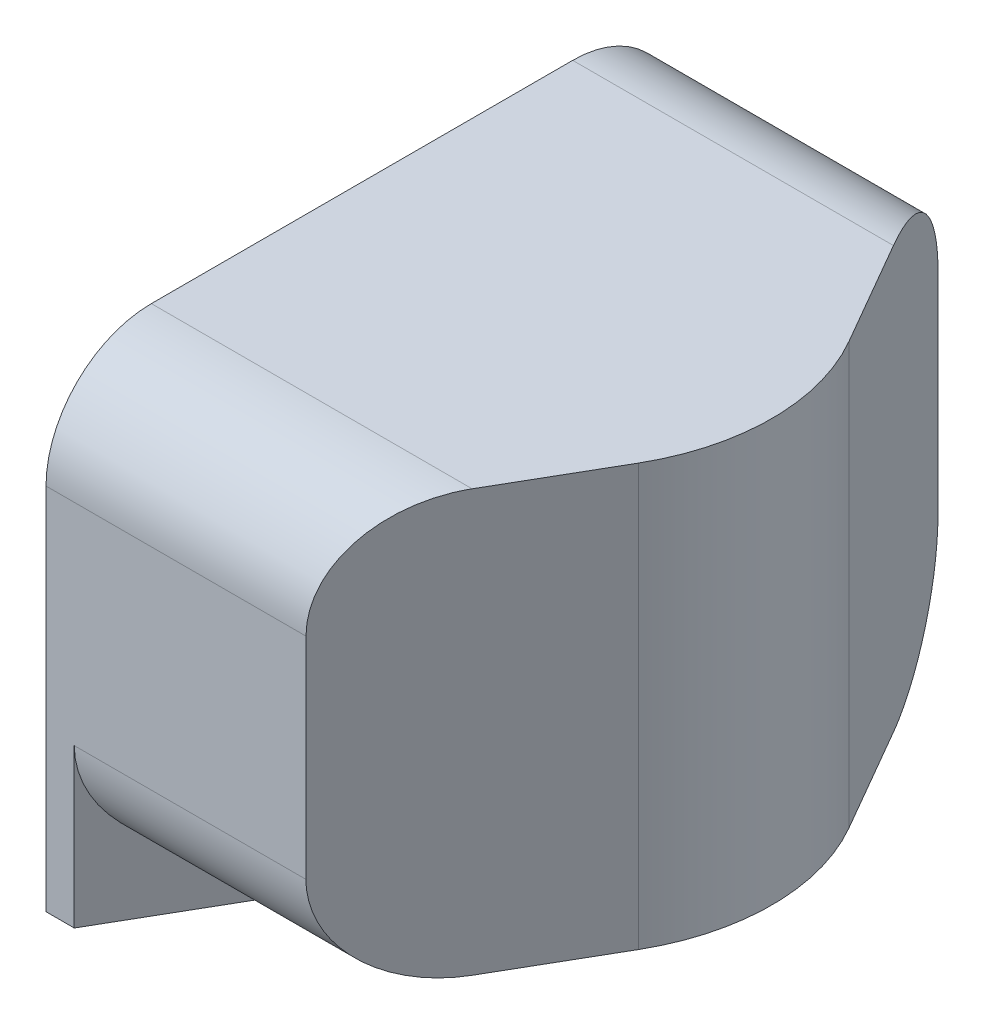
ISO-10303-21;
HEADER;
FILE_DESCRIPTION(('STEP AP214'),'2;1');
FILE_NAME('part.step','',(''),(''),'','','');
FILE_SCHEMA(('AUTOMOTIVE_DESIGN { 1 0 10303 214 1 1 1 1 }'));
ENDSEC;
DATA;
#1=APPLICATION_CONTEXT('core data for automotive mechanical design processes');
#2=APPLICATION_PROTOCOL_DEFINITION('international standard','automotive_design',2000,#1);
#3=PRODUCT_CONTEXT('',#1,'mechanical');
#4=PRODUCT('Part','Part','',(#3));
#5=PRODUCT_RELATED_PRODUCT_CATEGORY('part','',(#4));
#6=PRODUCT_DEFINITION_FORMATION('','',#4);
#7=PRODUCT_DEFINITION_CONTEXT('part definition',#1,'design');
#8=PRODUCT_DEFINITION('design','',#6,#7);
#9=PRODUCT_DEFINITION_SHAPE('','',#8);
#10=(LENGTH_UNIT() NAMED_UNIT(*) SI_UNIT(.MILLI.,.METRE.));
#11=(NAMED_UNIT(*) PLANE_ANGLE_UNIT() SI_UNIT($,.RADIAN.));
#12=(NAMED_UNIT(*) SI_UNIT($,.STERADIAN.) SOLID_ANGLE_UNIT());
#13=UNCERTAINTY_MEASURE_WITH_UNIT(LENGTH_MEASURE(1.E-05),#10,'distance_accuracy_value','');
#14=(GEOMETRIC_REPRESENTATION_CONTEXT(3) GLOBAL_UNCERTAINTY_ASSIGNED_CONTEXT((#13)) GLOBAL_UNIT_ASSIGNED_CONTEXT((#10,
#11,#12)) REPRESENTATION_CONTEXT('',''));
#15=CARTESIAN_POINT('',(0.,0.,0.));
#16=DIRECTION('',(0.,0.,1.));
#17=DIRECTION('',(1.,0.,0.));
#18=AXIS2_PLACEMENT_3D('',#15,#16,#17);
#19=CARTESIAN_POINT('',(18.8,-2.,-3.));
#20=DIRECTION('',(0.,0.,-1.));
#21=DIRECTION('',(-1.,0.,0.));
#22=AXIS2_PLACEMENT_3D('',#19,#20,#21);
#23=PLANE('',#22);
#24=DIRECTION('',(0.,1.,0.));
#25=VECTOR('',#24,1.);
#26=CARTESIAN_POINT('',(18.8,-2.,-3.));
#27=LINE('',#26,#25);
#28=CARTESIAN_POINT('',(18.8,-2.5,-3.));
#29=VERTEX_POINT('',#28);
#30=CARTESIAN_POINT('',(18.8,1.,-3.));
#31=VERTEX_POINT('',#30);
#32=EDGE_CURVE('E155',#29,#31,#27,.T.);
#33=ORIENTED_EDGE('',*,*,#32,.T.);
#34=DIRECTION('',(1.,0.,0.));
#35=VECTOR('',#34,1.);
#36=CARTESIAN_POINT('',(18.8,1.,-3.));
#37=LINE('',#36,#35);
#38=CARTESIAN_POINT('',(21.2679491924311,1.,-3.));
#39=VERTEX_POINT('',#38);
#40=EDGE_CURVE('E207',#31,#39,#37,.T.);
#41=ORIENTED_EDGE('',*,*,#40,.T.);
#42=DIRECTION('',(0.,1.,0.));
#43=VECTOR('',#42,1.);
#44=CARTESIAN_POINT('',(21.2679491924311,-2.,-3.));
#45=LINE('',#44,#43);
#46=CARTESIAN_POINT('',(21.2679491924311,-1.,-3.));
#47=VERTEX_POINT('',#46);
#48=EDGE_CURVE('E199',#47,#39,#45,.T.);
#49=ORIENTED_EDGE('',*,*,#48,.F.);
#50=DIRECTION('',(1.,0.,0.));
#51=VECTOR('',#50,1.);
#52=CARTESIAN_POINT('',(18.8,-1.,-3.));
#53=LINE('',#52,#51);
#54=CARTESIAN_POINT('',(19.0679491924311,-1.,-3.));
#55=VERTEX_POINT('',#54);
#56=EDGE_CURVE('E138',#47,#55,#53,.F.);
#57=ORIENTED_EDGE('',*,*,#56,.T.);
#58=DIRECTION('',(0.,1.,0.));
#59=VECTOR('',#58,1.);
#60=CARTESIAN_POINT('',(19.0679491924311,-2.5,-3.));
#61=LINE('',#60,#59);
#62=CARTESIAN_POINT('',(19.0679491924311,-2.5,-3.));
#63=VERTEX_POINT('',#62);
#64=EDGE_CURVE('E164',#63,#55,#61,.T.);
#65=ORIENTED_EDGE('',*,*,#64,.F.);
#66=DIRECTION('',(-1.,0.,0.));
#67=VECTOR('',#66,1.);
#68=CARTESIAN_POINT('',(0.,-2.5,-3.00000000000001));
#69=LINE('',#68,#67);
#70=EDGE_CURVE('E162',#63,#29,#69,.T.);
#71=ORIENTED_EDGE('',*,*,#70,.T.);
#72=EDGE_LOOP('',(#33,#41,#49,#57,#65,#71));
#73=FACE_BOUND('',#72,.T.);
#74=ADVANCED_FACE('F35',(#73),#23,.T.);
#75=CARTESIAN_POINT('',(18.8,-2.,3.));
#76=DIRECTION('',(0.,-1.,0.));
#77=DIRECTION('',(0.,0.,-1.));
#78=AXIS2_PLACEMENT_3D('',#75,#76,#77);
#79=PLANE('',#78);
#80=DIRECTION('',(0.5,0.,0.866025403784439));
#81=VECTOR('',#80,1.);
#82=CARTESIAN_POINT('',(21.5990381056767,-2.,1.38397459621556));
#83=LINE('',#82,#81);
#84=CARTESIAN_POINT('',(19.6452994616207,-2.,-2.));
#85=VERTEX_POINT('',#84);
#86=CARTESIAN_POINT('',(20.8,-2.,0.));
#87=VERTEX_POINT('',#86);
#88=EDGE_CURVE('E173',#85,#87,#83,.T.);
#89=ORIENTED_EDGE('',*,*,#88,.F.);
#90=DIRECTION('',(1.,0.,0.));
#91=VECTOR('',#90,1.);
#92=CARTESIAN_POINT('',(18.8,-2.,-2.));
#93=LINE('',#92,#91);
#94=CARTESIAN_POINT('',(21.8452994616208,-2.,-2.));
#95=VERTEX_POINT('',#94);
#96=EDGE_CURVE('E225',#85,#95,#93,.T.);
#97=ORIENTED_EDGE('',*,*,#96,.T.);
#98=DIRECTION('',(-0.5,0.,-0.866025403784439));
#99=VECTOR('',#98,1.);
#100=CARTESIAN_POINT('',(17.25,-2.,-9.95929214352105));
#101=LINE('',#100,#99);
#102=CARTESIAN_POINT('',(22.4226497308104,-2.,-1.00000000000001));
#103=VERTEX_POINT('',#102);
#104=EDGE_CURVE('E175',#103,#95,#101,.T.);
#105=ORIENTED_EDGE('',*,*,#104,.F.);
#106=CARTESIAN_POINT('',(20.6905989232415,-2.,0.));
#107=DIRECTION('',(0.,1.,0.));
#108=DIRECTION('',(0.,0.,1.));
#109=AXIS2_PLACEMENT_3D('',#106,#107,#108);
#110=CIRCLE('',#109,2.);
#111=CARTESIAN_POINT('',(22.4226497308104,-2.,0.999999999999994));
#112=VERTEX_POINT('',#111);
#113=EDGE_CURVE('E178',#103,#112,#110,.F.);
#114=ORIENTED_EDGE('',*,*,#113,.T.);
#115=DIRECTION('',(0.5,0.,-0.866025403784439));
#116=VECTOR('',#115,1.);
#117=CARTESIAN_POINT('',(17.25,-2.,9.95929214352104));
#118=LINE('',#117,#116);
#119=CARTESIAN_POINT('',(21.8452994616207,-2.,2.));
#120=VERTEX_POINT('',#119);
#121=EDGE_CURVE('E181',#120,#112,#118,.T.);
#122=ORIENTED_EDGE('',*,*,#121,.F.);
#123=DIRECTION('',(1.,0.,0.));
#124=VECTOR('',#123,1.);
#125=CARTESIAN_POINT('',(18.8,-2.,2.));
#126=LINE('',#125,#124);
#127=CARTESIAN_POINT('',(19.6452994616207,-2.,2.));
#128=VERTEX_POINT('',#127);
#129=EDGE_CURVE('E223',#120,#128,#126,.F.);
#130=ORIENTED_EDGE('',*,*,#129,.T.);
#131=DIRECTION('',(-0.5,0.,0.866025403784439));
#132=VECTOR('',#131,1.);
#133=CARTESIAN_POINT('',(19.0009618943233,-2.,3.11602540378444));
#134=LINE('',#133,#132);
#135=EDGE_CURVE('E166',#87,#128,#134,.T.);
#136=ORIENTED_EDGE('',*,*,#135,.F.);
#137=EDGE_LOOP('',(#89,#97,#105,#114,#122,#130,#136));
#138=FACE_BOUND('',#137,.T.);
#139=ADVANCED_FACE('F242',(#138),#79,.T.);
#140=CARTESIAN_POINT('',(18.8,-2.,3.));
#141=DIRECTION('',(0.,0.,1.));
#142=DIRECTION('',(1.,0.,0.));
#143=AXIS2_PLACEMENT_3D('',#140,#141,#142);
#144=PLANE('',#143);
#145=DIRECTION('',(0.,1.,0.));
#146=VECTOR('',#145,1.);
#147=CARTESIAN_POINT('',(19.0679491924311,-2.5,3.));
#148=LINE('',#147,#146);
#149=CARTESIAN_POINT('',(19.0679491924311,-2.5,3.));
#150=VERTEX_POINT('',#149);
#151=CARTESIAN_POINT('',(19.0679491924311,-1.,3.));
#152=VERTEX_POINT('',#151);
#153=EDGE_CURVE('E50',#150,#152,#148,.T.);
#154=ORIENTED_EDGE('',*,*,#153,.T.);
#155=DIRECTION('',(1.,0.,0.));
#156=VECTOR('',#155,1.);
#157=CARTESIAN_POINT('',(18.8,-1.,3.));
#158=LINE('',#157,#156);
#159=CARTESIAN_POINT('',(21.2679491924311,-1.,3.));
#160=VERTEX_POINT('',#159);
#161=EDGE_CURVE('E229',#152,#160,#158,.T.);
#162=ORIENTED_EDGE('',*,*,#161,.T.);
#163=DIRECTION('',(0.,-1.,0.));
#164=VECTOR('',#163,1.);
#165=CARTESIAN_POINT('',(21.2679491924311,-2.,3.));
#166=LINE('',#165,#164);
#167=CARTESIAN_POINT('',(21.2679491924311,1.,3.));
#168=VERTEX_POINT('',#167);
#169=EDGE_CURVE('E196',#168,#160,#166,.T.);
#170=ORIENTED_EDGE('',*,*,#169,.F.);
#171=DIRECTION('',(1.,0.,0.));
#172=VECTOR('',#171,1.);
#173=CARTESIAN_POINT('',(18.8,1.,3.));
#174=LINE('',#173,#172);
#175=CARTESIAN_POINT('',(18.8,1.,3.));
#176=VERTEX_POINT('',#175);
#177=EDGE_CURVE('E134',#168,#176,#174,.F.);
#178=ORIENTED_EDGE('',*,*,#177,.T.);
#179=DIRECTION('',(0.,-1.,0.));
#180=VECTOR('',#179,1.);
#181=CARTESIAN_POINT('',(18.8,-2.,3.));
#182=LINE('',#181,#180);
#183=CARTESIAN_POINT('',(18.8,-2.5,3.));
#184=VERTEX_POINT('',#183);
#185=EDGE_CURVE('E128',#176,#184,#182,.T.);
#186=ORIENTED_EDGE('',*,*,#185,.T.);
#187=DIRECTION('',(1.,0.,0.));
#188=VECTOR('',#187,1.);
#189=CARTESIAN_POINT('',(0.,-2.5,2.99999999999999));
#190=LINE('',#189,#188);
#191=EDGE_CURVE('E131',#184,#150,#190,.T.);
#192=ORIENTED_EDGE('',*,*,#191,.T.);
#193=EDGE_LOOP('',(#154,#162,#170,#178,#186,#192));
#194=FACE_BOUND('',#193,.T.);
#195=ADVANCED_FACE('F130',(#194),#144,.T.);
#196=CARTESIAN_POINT('',(18.8,2.,3.));
#197=DIRECTION('',(0.,1.,0.));
#198=DIRECTION('',(0.,0.,1.));
#199=AXIS2_PLACEMENT_3D('',#196,#197,#198);
#200=PLANE('',#199);
#201=DIRECTION('',(-0.5,0.,-0.866025403784439));
#202=VECTOR('',#201,1.);
#203=CARTESIAN_POINT('',(17.25,2.,-9.95929214352105));
#204=LINE('',#203,#202);
#205=CARTESIAN_POINT('',(22.4226497308104,2.,-1.00000000000001));
#206=VERTEX_POINT('',#205);
#207=CARTESIAN_POINT('',(21.8452994616208,2.,-2.));
#208=VERTEX_POINT('',#207);
#209=EDGE_CURVE('E183',#206,#208,#204,.T.);
#210=ORIENTED_EDGE('',*,*,#209,.T.);
#211=DIRECTION('',(1.,0.,0.));
#212=VECTOR('',#211,1.);
#213=CARTESIAN_POINT('',(18.8,2.,-2.));
#214=LINE('',#213,#212);
#215=CARTESIAN_POINT('',(18.8,2.,-2.));
#216=VERTEX_POINT('',#215);
#217=EDGE_CURVE('E217',#208,#216,#214,.F.);
#218=ORIENTED_EDGE('',*,*,#217,.T.);
#219=DIRECTION('',(0.,0.,1.));
#220=VECTOR('',#219,1.);
#221=CARTESIAN_POINT('',(18.8,2.,3.));
#222=LINE('',#221,#220);
#223=CARTESIAN_POINT('',(18.8,2.,2.));
#224=VERTEX_POINT('',#223);
#225=EDGE_CURVE('E139',#216,#224,#222,.T.);
#226=ORIENTED_EDGE('',*,*,#225,.T.);
#227=DIRECTION('',(1.,0.,0.));
#228=VECTOR('',#227,1.);
#229=CARTESIAN_POINT('',(18.8,2.,2.));
#230=LINE('',#229,#228);
#231=CARTESIAN_POINT('',(21.8452994616207,2.,2.));
#232=VERTEX_POINT('',#231);
#233=EDGE_CURVE('E214',#224,#232,#230,.T.);
#234=ORIENTED_EDGE('',*,*,#233,.T.);
#235=DIRECTION('',(0.5,0.,-0.866025403784439));
#236=VECTOR('',#235,1.);
#237=CARTESIAN_POINT('',(17.25,2.,9.95929214352104));
#238=LINE('',#237,#236);
#239=CARTESIAN_POINT('',(22.4226497308104,2.,0.999999999999994));
#240=VERTEX_POINT('',#239);
#241=EDGE_CURVE('E189',#232,#240,#238,.T.);
#242=ORIENTED_EDGE('',*,*,#241,.T.);
#243=CARTESIAN_POINT('',(20.6905989232415,2.,0.));
#244=DIRECTION('',(0.,1.,0.));
#245=DIRECTION('',(0.,0.,1.));
#246=AXIS2_PLACEMENT_3D('',#243,#244,#245);
#247=CIRCLE('',#246,2.);
#248=EDGE_CURVE('E186',#206,#240,#247,.F.);
#249=ORIENTED_EDGE('',*,*,#248,.F.);
#250=EDGE_LOOP('',(#210,#218,#226,#234,#242,#249));
#251=FACE_BOUND('',#250,.T.);
#252=ADVANCED_FACE('F257',(#251),#200,.T.);
#253=CARTESIAN_POINT('',(18.8,0.,0.));
#254=DIRECTION('',(-1.,0.,0.));
#255=DIRECTION('',(0.,0.,1.));
#256=AXIS2_PLACEMENT_3D('',#253,#254,#255);
#257=PLANE('',#256);
#258=ORIENTED_EDGE('',*,*,#225,.F.);
#259=CARTESIAN_POINT('',(18.8,1.,-2.));
#260=DIRECTION('',(-1.,0.,0.));
#261=DIRECTION('',(0.,0.,1.));
#262=AXIS2_PLACEMENT_3D('',#259,#260,#261);
#263=CIRCLE('',#262,1.);
#264=EDGE_CURVE('E221',#216,#31,#263,.T.);
#265=ORIENTED_EDGE('',*,*,#264,.T.);
#266=ORIENTED_EDGE('',*,*,#32,.F.);
#267=DIRECTION('',(0.,0.,1.));
#268=VECTOR('',#267,1.);
#269=CARTESIAN_POINT('',(18.8,-2.5,0.));
#270=LINE('',#269,#268);
#271=EDGE_CURVE('E146',#29,#184,#270,.T.);
#272=ORIENTED_EDGE('',*,*,#271,.T.);
#273=ORIENTED_EDGE('',*,*,#185,.F.);
#274=CARTESIAN_POINT('',(18.8,1.,2.));
#275=DIRECTION('',(-1.,0.,0.));
#276=DIRECTION('',(0.,0.,1.));
#277=AXIS2_PLACEMENT_3D('',#274,#275,#276);
#278=CIRCLE('',#277,1.);
#279=EDGE_CURVE('E219',#176,#224,#278,.T.);
#280=ORIENTED_EDGE('',*,*,#279,.T.);
#281=EDGE_LOOP('',(#258,#265,#266,#272,#273,#280));
#282=FACE_BOUND('',#281,.T.);
#283=ADVANCED_FACE('F153',(#282),#257,.T.);
#284=CARTESIAN_POINT('',(17.25,2.,-9.95929214352105));
#285=DIRECTION('',(-0.866025403784439,0.,0.5));
#286=DIRECTION('',(0.5,0.,0.866025403784438));
#287=AXIS2_PLACEMENT_3D('',#284,#285,#286);
#288=PLANE('',#287);
#289=ORIENTED_EDGE('',*,*,#48,.T.);
#290=CARTESIAN_POINT('',(21.8452994616208,1.,-2.));
#291=DIRECTION('',(-0.866025403784439,0.,0.5));
#292=DIRECTION('',(0.5,0.,0.866025403784438));
#293=AXIS2_PLACEMENT_3D('',#290,#291,#292);
#294=ELLIPSE('',#293,1.15470053837925,1.);
#295=EDGE_CURVE('E212',#39,#208,#294,.F.);
#296=ORIENTED_EDGE('',*,*,#295,.T.);
#297=ORIENTED_EDGE('',*,*,#209,.F.);
#298=DIRECTION('',(0.,-1.,0.));
#299=VECTOR('',#298,1.);
#300=CARTESIAN_POINT('',(22.4226497308104,2.,-1.00000000000001));
#301=LINE('',#300,#299);
#302=EDGE_CURVE('E194',#206,#103,#301,.T.);
#303=ORIENTED_EDGE('',*,*,#302,.T.);
#304=ORIENTED_EDGE('',*,*,#104,.T.);
#305=CARTESIAN_POINT('',(21.8452994616208,-1.,-2.));
#306=DIRECTION('',(-0.866025403784439,0.,0.5));
#307=DIRECTION('',(0.5,0.,0.866025403784438));
#308=AXIS2_PLACEMENT_3D('',#305,#306,#307);
#309=ELLIPSE('',#308,1.15470053837925,1.);
#310=EDGE_CURVE('E210',#95,#47,#309,.F.);
#311=ORIENTED_EDGE('',*,*,#310,.T.);
#312=EDGE_LOOP('',(#289,#296,#297,#303,#304,#311));
#313=FACE_BOUND('',#312,.T.);
#314=ADVANCED_FACE('F247',(#313),#288,.F.);
#315=CARTESIAN_POINT('',(20.6905989232415,2.,0.));
#316=DIRECTION('',(0.,-1.,0.));
#317=DIRECTION('',(0.,0.,-1.));
#318=AXIS2_PLACEMENT_3D('',#315,#316,#317);
#319=CYLINDRICAL_SURFACE('',#318,2.);
#320=ORIENTED_EDGE('',*,*,#302,.F.);
#321=ORIENTED_EDGE('',*,*,#248,.T.);
#322=DIRECTION('',(0.,-1.,0.));
#323=VECTOR('',#322,1.);
#324=CARTESIAN_POINT('',(22.4226497308104,2.,0.999999999999994));
#325=LINE('',#324,#323);
#326=EDGE_CURVE('E191',#240,#112,#325,.T.);
#327=ORIENTED_EDGE('',*,*,#326,.T.);
#328=ORIENTED_EDGE('',*,*,#113,.F.);
#329=EDGE_LOOP('',(#320,#321,#327,#328));
#330=FACE_BOUND('',#329,.T.);
#331=ADVANCED_FACE('F261',(#330),#319,.T.);
#332=CARTESIAN_POINT('',(17.25,2.,9.95929214352104));
#333=DIRECTION('',(-0.866025403784439,0.,-0.5));
#334=DIRECTION('',(-0.5,0.,0.866025403784439));
#335=AXIS2_PLACEMENT_3D('',#332,#333,#334);
#336=PLANE('',#335);
#337=ORIENTED_EDGE('',*,*,#169,.T.);
#338=CARTESIAN_POINT('',(21.8452994616207,-1.,2.));
#339=DIRECTION('',(-0.866025403784439,0.,-0.5));
#340=DIRECTION('',(0.5,0.,-0.866025403784439));
#341=AXIS2_PLACEMENT_3D('',#338,#339,#340);
#342=ELLIPSE('',#341,1.15470053837925,1.);
#343=EDGE_CURVE('E57',#160,#120,#342,.F.);
#344=ORIENTED_EDGE('',*,*,#343,.T.);
#345=ORIENTED_EDGE('',*,*,#121,.T.);
#346=ORIENTED_EDGE('',*,*,#326,.F.);
#347=ORIENTED_EDGE('',*,*,#241,.F.);
#348=CARTESIAN_POINT('',(21.8452994616207,1.,2.));
#349=DIRECTION('',(-0.866025403784439,0.,-0.5));
#350=DIRECTION('',(0.5,0.,-0.866025403784439));
#351=AXIS2_PLACEMENT_3D('',#348,#349,#350);
#352=ELLIPSE('',#351,1.15470053837925,1.);
#353=EDGE_CURVE('E231',#232,#168,#352,.F.);
#354=ORIENTED_EDGE('',*,*,#353,.T.);
#355=EDGE_LOOP('',(#337,#344,#345,#346,#347,#354));
#356=FACE_BOUND('',#355,.T.);
#357=ADVANCED_FACE('F276',(#356),#336,.F.);
#358=CARTESIAN_POINT('',(15.6,-2.5,-9.00666419935816));
#359=DIRECTION('',(0.866025403784439,0.,-0.5));
#360=DIRECTION('',(-0.5,0.,-0.866025403784439));
#361=AXIS2_PLACEMENT_3D('',#358,#359,#360);
#362=PLANE('',#361);
#363=ORIENTED_EDGE('',*,*,#64,.T.);
#364=CARTESIAN_POINT('',(19.6452994616207,-1.,-2.));
#365=DIRECTION('',(0.866025403784439,0.,-0.5));
#366=DIRECTION('',(0.5,0.,0.866025403784439));
#367=AXIS2_PLACEMENT_3D('',#364,#365,#366);
#368=ELLIPSE('',#367,1.15470053837925,1.);
#369=EDGE_CURVE('E43',#55,#85,#368,.F.);
#370=ORIENTED_EDGE('',*,*,#369,.T.);
#371=ORIENTED_EDGE('',*,*,#88,.T.);
#372=DIRECTION('',(0.,1.,0.));
#373=VECTOR('',#372,1.);
#374=CARTESIAN_POINT('',(20.8,-2.5,0.));
#375=LINE('',#374,#373);
#376=CARTESIAN_POINT('',(20.8,-2.5,0.));
#377=VERTEX_POINT('',#376);
#378=EDGE_CURVE('E167',#377,#87,#375,.T.);
#379=ORIENTED_EDGE('',*,*,#378,.F.);
#380=DIRECTION('',(-0.5,0.,-0.866025403784439));
#381=VECTOR('',#380,1.);
#382=CARTESIAN_POINT('',(15.6,-2.5,-9.00666419935816));
#383=LINE('',#382,#381);
#384=EDGE_CURVE('E159',#377,#63,#383,.T.);
#385=ORIENTED_EDGE('',*,*,#384,.T.);
#386=EDGE_LOOP('',(#363,#370,#371,#379,#385));
#387=FACE_BOUND('',#386,.T.);
#388=ADVANCED_FACE('F236',(#387),#362,.T.);
#389=CARTESIAN_POINT('',(15.6,-2.5,9.00666419935816));
#390=DIRECTION('',(0.866025403784439,0.,0.5));
#391=DIRECTION('',(0.5,0.,-0.866025403784439));
#392=AXIS2_PLACEMENT_3D('',#389,#390,#391);
#393=PLANE('',#392);
#394=ORIENTED_EDGE('',*,*,#378,.T.);
#395=ORIENTED_EDGE('',*,*,#135,.T.);
#396=CARTESIAN_POINT('',(19.6452994616207,-1.,2.));
#397=DIRECTION('',(0.866025403784439,0.,0.5));
#398=DIRECTION('',(0.5,0.,-0.866025403784439));
#399=AXIS2_PLACEMENT_3D('',#396,#397,#398);
#400=ELLIPSE('',#399,1.15470053837925,1.);
#401=EDGE_CURVE('E11',#128,#152,#400,.F.);
#402=ORIENTED_EDGE('',*,*,#401,.T.);
#403=ORIENTED_EDGE('',*,*,#153,.F.);
#404=DIRECTION('',(0.5,0.,-0.866025403784439));
#405=VECTOR('',#404,1.);
#406=CARTESIAN_POINT('',(15.6,-2.5,9.00666419935816));
#407=LINE('',#406,#405);
#408=EDGE_CURVE('E150',#150,#377,#407,.T.);
#409=ORIENTED_EDGE('',*,*,#408,.T.);
#410=EDGE_LOOP('',(#394,#395,#402,#403,#409));
#411=FACE_BOUND('',#410,.T.);
#412=ADVANCED_FACE('F268',(#411),#393,.T.);
#413=CARTESIAN_POINT('',(0.,-2.5,0.));
#414=DIRECTION('',(0.,1.,0.));
#415=DIRECTION('',(0.,0.,1.));
#416=AXIS2_PLACEMENT_3D('',#413,#414,#415);
#417=PLANE('',#416);
#418=ORIENTED_EDGE('',*,*,#271,.F.);
#419=ORIENTED_EDGE('',*,*,#70,.F.);
#420=ORIENTED_EDGE('',*,*,#384,.F.);
#421=ORIENTED_EDGE('',*,*,#408,.F.);
#422=ORIENTED_EDGE('',*,*,#191,.F.);
#423=EDGE_LOOP('',(#418,#419,#420,#421,#422));
#424=FACE_BOUND('',#423,.T.);
#425=ADVANCED_FACE('F144',(#424),#417,.F.);
#426=CARTESIAN_POINT('',(18.8,1.,-2.));
#427=DIRECTION('',(1.,0.,0.));
#428=DIRECTION('',(0.,0.,-1.));
#429=AXIS2_PLACEMENT_3D('',#426,#427,#428);
#430=CYLINDRICAL_SURFACE('',#429,1.);
#431=ORIENTED_EDGE('',*,*,#264,.F.);
#432=ORIENTED_EDGE('',*,*,#217,.F.);
#433=ORIENTED_EDGE('',*,*,#295,.F.);
#434=ORIENTED_EDGE('',*,*,#40,.F.);
#435=EDGE_LOOP('',(#431,#432,#433,#434));
#436=FACE_BOUND('',#435,.T.);
#437=ADVANCED_FACE('F252',(#436),#430,.T.);
#438=CARTESIAN_POINT('',(18.8,-1.,-2.));
#439=DIRECTION('',(1.,0.,0.));
#440=DIRECTION('',(0.,0.,-1.));
#441=AXIS2_PLACEMENT_3D('',#438,#439,#440);
#442=CYLINDRICAL_SURFACE('',#441,1.);
#443=ORIENTED_EDGE('',*,*,#369,.F.);
#444=ORIENTED_EDGE('',*,*,#56,.F.);
#445=ORIENTED_EDGE('',*,*,#310,.F.);
#446=ORIENTED_EDGE('',*,*,#96,.F.);
#447=EDGE_LOOP('',(#443,#444,#445,#446));
#448=FACE_BOUND('',#447,.T.);
#449=ADVANCED_FACE('F244',(#448),#442,.T.);
#450=CARTESIAN_POINT('',(18.8,-1.,2.));
#451=DIRECTION('',(1.,0.,0.));
#452=DIRECTION('',(0.,0.,-1.));
#453=AXIS2_PLACEMENT_3D('',#450,#451,#452);
#454=CYLINDRICAL_SURFACE('',#453,1.);
#455=ORIENTED_EDGE('',*,*,#401,.F.);
#456=ORIENTED_EDGE('',*,*,#129,.F.);
#457=ORIENTED_EDGE('',*,*,#343,.F.);
#458=ORIENTED_EDGE('',*,*,#161,.F.);
#459=EDGE_LOOP('',(#455,#456,#457,#458));
#460=FACE_BOUND('',#459,.T.);
#461=ADVANCED_FACE('F266',(#460),#454,.T.);
#462=CARTESIAN_POINT('',(18.8,1.,2.));
#463=DIRECTION('',(1.,0.,0.));
#464=DIRECTION('',(0.,0.,-1.));
#465=AXIS2_PLACEMENT_3D('',#462,#463,#464);
#466=CYLINDRICAL_SURFACE('',#465,1.);
#467=ORIENTED_EDGE('',*,*,#279,.F.);
#468=ORIENTED_EDGE('',*,*,#177,.F.);
#469=ORIENTED_EDGE('',*,*,#353,.F.);
#470=ORIENTED_EDGE('',*,*,#233,.F.);
#471=EDGE_LOOP('',(#467,#468,#469,#470));
#472=FACE_BOUND('',#471,.T.);
#473=ADVANCED_FACE('F37',(#472),#466,.T.);
#474=CLOSED_SHELL('',(#74,#139,#195,#252,#283,#314,#331,#357,#388,#412,#425,#437,#449,#461,#473));
#475=MANIFOLD_SOLID_BREP('B2',#474);
#476=ADVANCED_BREP_SHAPE_REPRESENTATION('',(#18,#475),#14);
#477=SHAPE_DEFINITION_REPRESENTATION(#9,#476);
ENDSEC;
END-ISO-10303-21;
